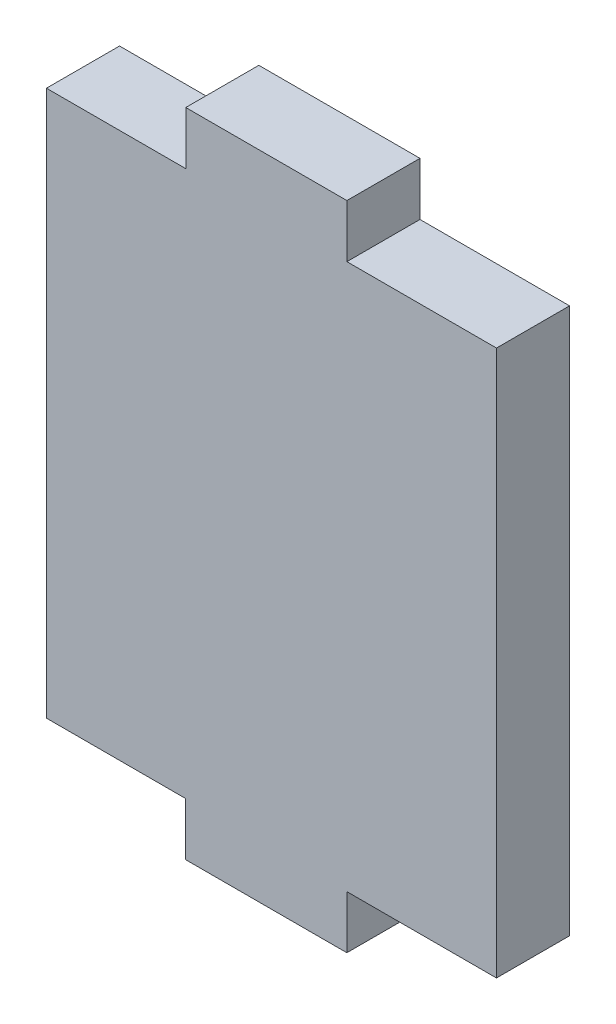
ISO-10303-21;
HEADER;
FILE_DESCRIPTION(('STEP AP214'),'2;1');
FILE_NAME('part.step','',(''),(''),'','','');
FILE_SCHEMA(('AUTOMOTIVE_DESIGN { 1 0 10303 214 1 1 1 1 }'));
ENDSEC;
DATA;
#1=APPLICATION_CONTEXT('core data for automotive mechanical design processes');
#2=APPLICATION_PROTOCOL_DEFINITION('international standard','automotive_design',2000,#1);
#3=PRODUCT_CONTEXT('',#1,'mechanical');
#4=PRODUCT('Part','Part','',(#3));
#5=PRODUCT_RELATED_PRODUCT_CATEGORY('part','',(#4));
#6=PRODUCT_DEFINITION_FORMATION('','',#4);
#7=PRODUCT_DEFINITION_CONTEXT('part definition',#1,'design');
#8=PRODUCT_DEFINITION('design','',#6,#7);
#9=PRODUCT_DEFINITION_SHAPE('','',#8);
#10=(LENGTH_UNIT() NAMED_UNIT(*) SI_UNIT(.MILLI.,.METRE.));
#11=(NAMED_UNIT(*) PLANE_ANGLE_UNIT() SI_UNIT($,.RADIAN.));
#12=(NAMED_UNIT(*) SI_UNIT($,.STERADIAN.) SOLID_ANGLE_UNIT());
#13=UNCERTAINTY_MEASURE_WITH_UNIT(LENGTH_MEASURE(1.E-05),#10,'distance_accuracy_value','');
#14=(GEOMETRIC_REPRESENTATION_CONTEXT(3) GLOBAL_UNCERTAINTY_ASSIGNED_CONTEXT((#13)) GLOBAL_UNIT_ASSIGNED_CONTEXT((#10,
#11,#12)) REPRESENTATION_CONTEXT('',''));
#15=CARTESIAN_POINT('',(0.,0.,0.));
#16=DIRECTION('',(0.,0.,1.));
#17=DIRECTION('',(1.,0.,0.));
#18=AXIS2_PLACEMENT_3D('',#15,#16,#17);
#19=CARTESIAN_POINT('',(0.,0.,3.175));
#20=DIRECTION('',(0.,1.,0.));
#21=DIRECTION('',(0.,0.,1.));
#22=AXIS2_PLACEMENT_3D('',#19,#20,#21);
#23=PLANE('',#22);
#24=DIRECTION('',(0.,0.,1.));
#25=VECTOR('',#24,1.);
#26=CARTESIAN_POINT('',(13.5,0.,0.));
#27=LINE('',#26,#25);
#28=CARTESIAN_POINT('',(13.5,0.,0.));
#29=VERTEX_POINT('',#28);
#30=CARTESIAN_POINT('',(13.5,0.,3.175));
#31=VERTEX_POINT('',#30);
#32=EDGE_CURVE('E207',#29,#31,#27,.T.);
#33=ORIENTED_EDGE('',*,*,#32,.F.);
#34=DIRECTION('',(1.,0.,0.));
#35=VECTOR('',#34,1.);
#36=CARTESIAN_POINT('',(0.,0.,0.));
#37=LINE('',#36,#35);
#38=CARTESIAN_POINT('',(20.,0.,0.));
#39=VERTEX_POINT('',#38);
#40=EDGE_CURVE('E165',#29,#39,#37,.T.);
#41=ORIENTED_EDGE('',*,*,#40,.T.);
#42=DIRECTION('',(0.,0.,-1.));
#43=VECTOR('',#42,1.);
#44=CARTESIAN_POINT('',(20.,0.,3.175));
#45=LINE('',#44,#43);
#46=CARTESIAN_POINT('',(20.,0.,3.175));
#47=VERTEX_POINT('',#46);
#48=EDGE_CURVE('E47',#47,#39,#45,.T.);
#49=ORIENTED_EDGE('',*,*,#48,.F.);
#50=DIRECTION('',(1.,0.,0.));
#51=VECTOR('',#50,1.);
#52=CARTESIAN_POINT('',(0.,0.,3.175));
#53=LINE('',#52,#51);
#54=EDGE_CURVE('E146',#31,#47,#53,.T.);
#55=ORIENTED_EDGE('',*,*,#54,.F.);
#56=EDGE_LOOP('',(#33,#41,#49,#55));
#57=FACE_BOUND('',#56,.T.);
#58=ADVANCED_FACE('F38',(#57),#23,.F.);
#59=CARTESIAN_POINT('',(0.,23.7,3.175));
#60=DIRECTION('',(0.,-1.,0.));
#61=DIRECTION('',(0.,0.,-1.));
#62=AXIS2_PLACEMENT_3D('',#59,#60,#61);
#63=PLANE('',#62);
#64=DIRECTION('',(-1.,0.,0.));
#65=VECTOR('',#64,1.);
#66=CARTESIAN_POINT('',(0.,23.7,0.));
#67=LINE('',#66,#65);
#68=CARTESIAN_POINT('',(6.502051165,23.7,0.));
#69=VERTEX_POINT('',#68);
#70=CARTESIAN_POINT('',(0.449999999999998,23.7,0.));
#71=VERTEX_POINT('',#70);
#72=EDGE_CURVE('E168',#69,#71,#67,.T.);
#73=ORIENTED_EDGE('',*,*,#72,.T.);
#74=DIRECTION('',(0.,0.,1.));
#75=VECTOR('',#74,1.);
#76=CARTESIAN_POINT('',(0.449999999999997,23.7,-6.825));
#77=LINE('',#76,#75);
#78=CARTESIAN_POINT('',(0.449999999999997,23.7,3.175));
#79=VERTEX_POINT('',#78);
#80=EDGE_CURVE('E53',#71,#79,#77,.T.);
#81=ORIENTED_EDGE('',*,*,#80,.T.);
#82=DIRECTION('',(-1.,0.,0.));
#83=VECTOR('',#82,1.);
#84=CARTESIAN_POINT('',(0.,23.7,3.175));
#85=LINE('',#84,#83);
#86=CARTESIAN_POINT('',(6.502051165,23.7,3.175));
#87=VERTEX_POINT('',#86);
#88=EDGE_CURVE('E138',#87,#79,#85,.T.);
#89=ORIENTED_EDGE('',*,*,#88,.F.);
#90=DIRECTION('',(0.,0.,1.));
#91=VECTOR('',#90,1.);
#92=CARTESIAN_POINT('',(6.502051165,23.7,0.));
#93=LINE('',#92,#91);
#94=EDGE_CURVE('E153',#69,#87,#93,.T.);
#95=ORIENTED_EDGE('',*,*,#94,.F.);
#96=EDGE_LOOP('',(#73,#81,#89,#95));
#97=FACE_BOUND('',#96,.T.);
#98=ADVANCED_FACE('F254',(#97),#63,.F.);
#99=CARTESIAN_POINT('',(0.45,0.,3.175));
#100=VERTEX_POINT('',#99);
#101=CARTESIAN_POINT('',(6.5,0.,3.175));
#102=VERTEX_POINT('',#101);
#103=EDGE_CURVE('E61',#100,#102,#53,.T.);
#104=ORIENTED_EDGE('',*,*,#103,.F.);
#105=DIRECTION('',(0.,0.,1.));
#106=VECTOR('',#105,1.);
#107=CARTESIAN_POINT('',(0.45,0.,-6.825));
#108=LINE('',#107,#106);
#109=CARTESIAN_POINT('',(0.45,0.,0.));
#110=VERTEX_POINT('',#109);
#111=EDGE_CURVE('E127',#110,#100,#108,.T.);
#112=ORIENTED_EDGE('',*,*,#111,.F.);
#113=CARTESIAN_POINT('',(6.5,0.,0.));
#114=VERTEX_POINT('',#113);
#115=EDGE_CURVE('E161',#110,#114,#37,.T.);
#116=ORIENTED_EDGE('',*,*,#115,.T.);
#117=DIRECTION('',(0.,0.,1.));
#118=VECTOR('',#117,1.);
#119=CARTESIAN_POINT('',(6.5,0.,0.));
#120=LINE('',#119,#118);
#121=EDGE_CURVE('E143',#114,#102,#120,.T.);
#122=ORIENTED_EDGE('',*,*,#121,.T.);
#123=EDGE_LOOP('',(#104,#112,#116,#122));
#124=FACE_BOUND('',#123,.T.);
#125=ADVANCED_FACE('F40',(#124),#23,.F.);
#126=CARTESIAN_POINT('',(20.,0.,3.175));
#127=DIRECTION('',(-1.,0.,0.));
#128=DIRECTION('',(0.,0.,1.));
#129=AXIS2_PLACEMENT_3D('',#126,#127,#128);
#130=PLANE('',#129);
#131=DIRECTION('',(0.,1.,0.));
#132=VECTOR('',#131,1.);
#133=CARTESIAN_POINT('',(20.,0.,0.));
#134=LINE('',#133,#132);
#135=CARTESIAN_POINT('',(20.,23.7,0.));
#136=VERTEX_POINT('',#135);
#137=EDGE_CURVE('E164',#39,#136,#134,.T.);
#138=ORIENTED_EDGE('',*,*,#137,.T.);
#139=DIRECTION('',(0.,0.,-1.));
#140=VECTOR('',#139,1.);
#141=CARTESIAN_POINT('',(20.,23.7,3.175));
#142=LINE('',#141,#140);
#143=CARTESIAN_POINT('',(20.,23.7,3.175));
#144=VERTEX_POINT('',#143);
#145=EDGE_CURVE('E160',#144,#136,#142,.T.);
#146=ORIENTED_EDGE('',*,*,#145,.F.);
#147=DIRECTION('',(0.,1.,0.));
#148=VECTOR('',#147,1.);
#149=CARTESIAN_POINT('',(20.,0.,3.175));
#150=LINE('',#149,#148);
#151=EDGE_CURVE('E145',#47,#144,#150,.T.);
#152=ORIENTED_EDGE('',*,*,#151,.F.);
#153=ORIENTED_EDGE('',*,*,#48,.T.);
#154=EDGE_LOOP('',(#138,#146,#152,#153));
#155=FACE_BOUND('',#154,.T.);
#156=ADVANCED_FACE('F180',(#155),#130,.F.);
#157=CARTESIAN_POINT('',(13.502051165,23.7,0.));
#158=VERTEX_POINT('',#157);
#159=EDGE_CURVE('E151',#136,#158,#67,.T.);
#160=ORIENTED_EDGE('',*,*,#159,.T.);
#161=DIRECTION('',(0.,0.,1.));
#162=VECTOR('',#161,1.);
#163=CARTESIAN_POINT('',(13.502051165,23.7,0.));
#164=LINE('',#163,#162);
#165=CARTESIAN_POINT('',(13.502051165,23.7,3.175));
#166=VERTEX_POINT('',#165);
#167=EDGE_CURVE('E197',#158,#166,#164,.T.);
#168=ORIENTED_EDGE('',*,*,#167,.T.);
#169=EDGE_CURVE('E156',#144,#166,#85,.T.);
#170=ORIENTED_EDGE('',*,*,#169,.F.);
#171=ORIENTED_EDGE('',*,*,#145,.T.);
#172=EDGE_LOOP('',(#160,#168,#170,#171));
#173=FACE_BOUND('',#172,.T.);
#174=ADVANCED_FACE('F195',(#173),#63,.F.);
#175=CARTESIAN_POINT('',(0.,0.,3.175));
#176=DIRECTION('',(0.,0.,-1.));
#177=DIRECTION('',(-1.,0.,0.));
#178=AXIS2_PLACEMENT_3D('',#175,#176,#177);
#179=PLANE('',#178);
#180=ORIENTED_EDGE('',*,*,#88,.T.);
#181=DIRECTION('',(0.,1.,0.));
#182=VECTOR('',#181,1.);
#183=CARTESIAN_POINT('',(0.449999999999997,23.7,3.175));
#184=LINE('',#183,#182);
#185=EDGE_CURVE('E129',#100,#79,#184,.T.);
#186=ORIENTED_EDGE('',*,*,#185,.F.);
#187=ORIENTED_EDGE('',*,*,#103,.T.);
#188=DIRECTION('',(0.,-1.,0.));
#189=VECTOR('',#188,1.);
#190=CARTESIAN_POINT('',(6.5,0.,3.175));
#191=LINE('',#190,#189);
#192=CARTESIAN_POINT('',(6.5,-2.3,3.175));
#193=VERTEX_POINT('',#192);
#194=EDGE_CURVE('E257',#102,#193,#191,.T.);
#195=ORIENTED_EDGE('',*,*,#194,.T.);
#196=DIRECTION('',(1.,0.,0.));
#197=VECTOR('',#196,1.);
#198=CARTESIAN_POINT('',(6.5,-2.3,3.175));
#199=LINE('',#198,#197);
#200=CARTESIAN_POINT('',(13.5,-2.3,3.175));
#201=VERTEX_POINT('',#200);
#202=EDGE_CURVE('E260',#193,#201,#199,.T.);
#203=ORIENTED_EDGE('',*,*,#202,.T.);
#204=DIRECTION('',(0.,1.,0.));
#205=VECTOR('',#204,1.);
#206=CARTESIAN_POINT('',(13.5,0.,3.175));
#207=LINE('',#206,#205);
#208=EDGE_CURVE('E205',#201,#31,#207,.T.);
#209=ORIENTED_EDGE('',*,*,#208,.T.);
#210=ORIENTED_EDGE('',*,*,#54,.T.);
#211=ORIENTED_EDGE('',*,*,#151,.T.);
#212=ORIENTED_EDGE('',*,*,#169,.T.);
#213=DIRECTION('',(0.,1.,0.));
#214=VECTOR('',#213,1.);
#215=CARTESIAN_POINT('',(13.502051165,23.7,3.175));
#216=LINE('',#215,#214);
#217=CARTESIAN_POINT('',(13.502051165,26.,3.175));
#218=VERTEX_POINT('',#217);
#219=EDGE_CURVE('E200',#166,#218,#216,.T.);
#220=ORIENTED_EDGE('',*,*,#219,.T.);
#221=DIRECTION('',(-1.,0.,0.));
#222=VECTOR('',#221,1.);
#223=CARTESIAN_POINT('',(6.502051165,26.,3.175));
#224=LINE('',#223,#222);
#225=CARTESIAN_POINT('',(6.502051165,26.,3.175));
#226=VERTEX_POINT('',#225);
#227=EDGE_CURVE('E226',#218,#226,#224,.T.);
#228=ORIENTED_EDGE('',*,*,#227,.T.);
#229=DIRECTION('',(0.,-1.,0.));
#230=VECTOR('',#229,1.);
#231=CARTESIAN_POINT('',(6.502051165,23.7,3.175));
#232=LINE('',#231,#230);
#233=EDGE_CURVE('E214',#226,#87,#232,.T.);
#234=ORIENTED_EDGE('',*,*,#233,.T.);
#235=EDGE_LOOP('',(#180,#186,#187,#195,#203,#209,#210,#211,#212,#220,#228,#234));
#236=FACE_BOUND('',#235,.T.);
#237=ADVANCED_FACE('F135',(#236),#179,.F.);
#238=CARTESIAN_POINT('',(0.,0.,0.));
#239=DIRECTION('',(0.,0.,-1.));
#240=DIRECTION('',(-1.,0.,0.));
#241=AXIS2_PLACEMENT_3D('',#238,#239,#240);
#242=PLANE('',#241);
#243=DIRECTION('',(0.,-1.,0.));
#244=VECTOR('',#243,1.);
#245=CARTESIAN_POINT('',(0.45,0.,0.));
#246=LINE('',#245,#244);
#247=EDGE_CURVE('E11',#71,#110,#246,.T.);
#248=ORIENTED_EDGE('',*,*,#247,.F.);
#249=ORIENTED_EDGE('',*,*,#72,.F.);
#250=DIRECTION('',(0.,-1.,0.));
#251=VECTOR('',#250,1.);
#252=CARTESIAN_POINT('',(6.502051165,23.7,0.));
#253=LINE('',#252,#251);
#254=CARTESIAN_POINT('',(6.502051165,26.,0.));
#255=VERTEX_POINT('',#254);
#256=EDGE_CURVE('E223',#255,#69,#253,.T.);
#257=ORIENTED_EDGE('',*,*,#256,.F.);
#258=DIRECTION('',(-1.,0.,0.));
#259=VECTOR('',#258,1.);
#260=CARTESIAN_POINT('',(6.502051165,26.,0.));
#261=LINE('',#260,#259);
#262=CARTESIAN_POINT('',(13.502051165,26.,0.));
#263=VERTEX_POINT('',#262);
#264=EDGE_CURVE('E229',#263,#255,#261,.T.);
#265=ORIENTED_EDGE('',*,*,#264,.F.);
#266=DIRECTION('',(0.,1.,0.));
#267=VECTOR('',#266,1.);
#268=CARTESIAN_POINT('',(13.502051165,23.7,0.));
#269=LINE('',#268,#267);
#270=EDGE_CURVE('E192',#158,#263,#269,.T.);
#271=ORIENTED_EDGE('',*,*,#270,.F.);
#272=ORIENTED_EDGE('',*,*,#159,.F.);
#273=ORIENTED_EDGE('',*,*,#137,.F.);
#274=ORIENTED_EDGE('',*,*,#40,.F.);
#275=DIRECTION('',(0.,1.,0.));
#276=VECTOR('',#275,1.);
#277=CARTESIAN_POINT('',(13.5,0.,0.));
#278=LINE('',#277,#276);
#279=CARTESIAN_POINT('',(13.5,-2.3,0.));
#280=VERTEX_POINT('',#279);
#281=EDGE_CURVE('E222',#280,#29,#278,.T.);
#282=ORIENTED_EDGE('',*,*,#281,.F.);
#283=DIRECTION('',(1.,0.,0.));
#284=VECTOR('',#283,1.);
#285=CARTESIAN_POINT('',(6.5,-2.3,0.));
#286=LINE('',#285,#284);
#287=CARTESIAN_POINT('',(6.5,-2.3,0.));
#288=VERTEX_POINT('',#287);
#289=EDGE_CURVE('E267',#288,#280,#286,.T.);
#290=ORIENTED_EDGE('',*,*,#289,.F.);
#291=DIRECTION('',(0.,-1.,0.));
#292=VECTOR('',#291,1.);
#293=CARTESIAN_POINT('',(6.5,0.,0.));
#294=LINE('',#293,#292);
#295=EDGE_CURVE('E263',#114,#288,#294,.T.);
#296=ORIENTED_EDGE('',*,*,#295,.F.);
#297=ORIENTED_EDGE('',*,*,#115,.F.);
#298=EDGE_LOOP('',(#248,#249,#257,#265,#271,#272,#273,#274,#282,#290,#296,#297));
#299=FACE_BOUND('',#298,.T.);
#300=ADVANCED_FACE('F187',(#299),#242,.T.);
#301=CARTESIAN_POINT('',(6.502051165,23.7,0.));
#302=DIRECTION('',(-1.,0.,0.));
#303=DIRECTION('',(0.,-1.,0.));
#304=AXIS2_PLACEMENT_3D('',#301,#302,#303);
#305=PLANE('',#304);
#306=ORIENTED_EDGE('',*,*,#233,.F.);
#307=DIRECTION('',(0.,0.,1.));
#308=VECTOR('',#307,1.);
#309=CARTESIAN_POINT('',(6.502051165,26.,0.));
#310=LINE('',#309,#308);
#311=EDGE_CURVE('E239',#255,#226,#310,.T.);
#312=ORIENTED_EDGE('',*,*,#311,.F.);
#313=ORIENTED_EDGE('',*,*,#256,.T.);
#314=ORIENTED_EDGE('',*,*,#94,.T.);
#315=EDGE_LOOP('',(#306,#312,#313,#314));
#316=FACE_BOUND('',#315,.T.);
#317=ADVANCED_FACE('F249',(#316),#305,.T.);
#318=CARTESIAN_POINT('',(6.502051165,26.,0.));
#319=DIRECTION('',(0.,1.,0.));
#320=DIRECTION('',(0.,0.,1.));
#321=AXIS2_PLACEMENT_3D('',#318,#319,#320);
#322=PLANE('',#321);
#323=ORIENTED_EDGE('',*,*,#227,.F.);
#324=DIRECTION('',(0.,0.,1.));
#325=VECTOR('',#324,1.);
#326=CARTESIAN_POINT('',(13.502051165,26.,0.));
#327=LINE('',#326,#325);
#328=EDGE_CURVE('E242',#263,#218,#327,.T.);
#329=ORIENTED_EDGE('',*,*,#328,.F.);
#330=ORIENTED_EDGE('',*,*,#264,.T.);
#331=ORIENTED_EDGE('',*,*,#311,.T.);
#332=EDGE_LOOP('',(#323,#329,#330,#331));
#333=FACE_BOUND('',#332,.T.);
#334=ADVANCED_FACE('F312',(#333),#322,.T.);
#335=CARTESIAN_POINT('',(13.502051165,23.7,0.));
#336=DIRECTION('',(1.,0.,0.));
#337=DIRECTION('',(0.,0.,-1.));
#338=AXIS2_PLACEMENT_3D('',#335,#336,#337);
#339=PLANE('',#338);
#340=ORIENTED_EDGE('',*,*,#219,.F.);
#341=ORIENTED_EDGE('',*,*,#167,.F.);
#342=ORIENTED_EDGE('',*,*,#270,.T.);
#343=ORIENTED_EDGE('',*,*,#328,.T.);
#344=EDGE_LOOP('',(#340,#341,#342,#343));
#345=FACE_BOUND('',#344,.T.);
#346=ADVANCED_FACE('F288',(#345),#339,.T.);
#347=CARTESIAN_POINT('',(6.5,0.,0.));
#348=DIRECTION('',(-1.,0.,0.));
#349=DIRECTION('',(0.,0.,1.));
#350=AXIS2_PLACEMENT_3D('',#347,#348,#349);
#351=PLANE('',#350);
#352=ORIENTED_EDGE('',*,*,#194,.F.);
#353=ORIENTED_EDGE('',*,*,#121,.F.);
#354=ORIENTED_EDGE('',*,*,#295,.T.);
#355=DIRECTION('',(0.,0.,1.));
#356=VECTOR('',#355,1.);
#357=CARTESIAN_POINT('',(6.5,-2.3,0.));
#358=LINE('',#357,#356);
#359=EDGE_CURVE('E216',#288,#193,#358,.T.);
#360=ORIENTED_EDGE('',*,*,#359,.T.);
#361=EDGE_LOOP('',(#352,#353,#354,#360));
#362=FACE_BOUND('',#361,.T.);
#363=ADVANCED_FACE('F281',(#362),#351,.T.);
#364=CARTESIAN_POINT('',(13.5,0.,0.));
#365=DIRECTION('',(1.,0.,0.));
#366=DIRECTION('',(0.,0.,-1.));
#367=AXIS2_PLACEMENT_3D('',#364,#365,#366);
#368=PLANE('',#367);
#369=ORIENTED_EDGE('',*,*,#208,.F.);
#370=DIRECTION('',(0.,0.,1.));
#371=VECTOR('',#370,1.);
#372=CARTESIAN_POINT('',(13.5,-2.3,0.));
#373=LINE('',#372,#371);
#374=EDGE_CURVE('E210',#280,#201,#373,.T.);
#375=ORIENTED_EDGE('',*,*,#374,.F.);
#376=ORIENTED_EDGE('',*,*,#281,.T.);
#377=ORIENTED_EDGE('',*,*,#32,.T.);
#378=EDGE_LOOP('',(#369,#375,#376,#377));
#379=FACE_BOUND('',#378,.T.);
#380=ADVANCED_FACE('F279',(#379),#368,.T.);
#381=CARTESIAN_POINT('',(6.5,-2.3,0.));
#382=DIRECTION('',(0.,-1.,0.));
#383=DIRECTION('',(0.,0.,-1.));
#384=AXIS2_PLACEMENT_3D('',#381,#382,#383);
#385=PLANE('',#384);
#386=ORIENTED_EDGE('',*,*,#202,.F.);
#387=ORIENTED_EDGE('',*,*,#359,.F.);
#388=ORIENTED_EDGE('',*,*,#289,.T.);
#389=ORIENTED_EDGE('',*,*,#374,.T.);
#390=EDGE_LOOP('',(#386,#387,#388,#389));
#391=FACE_BOUND('',#390,.T.);
#392=ADVANCED_FACE('F277',(#391),#385,.T.);
#393=CARTESIAN_POINT('',(0.449999999999997,23.7,-6.825));
#394=DIRECTION('',(1.,0.,0.));
#395=DIRECTION('',(0.,1.,0.));
#396=AXIS2_PLACEMENT_3D('',#393,#394,#395);
#397=PLANE('',#396);
#398=ORIENTED_EDGE('',*,*,#247,.T.);
#399=ORIENTED_EDGE('',*,*,#111,.T.);
#400=ORIENTED_EDGE('',*,*,#185,.T.);
#401=ORIENTED_EDGE('',*,*,#80,.F.);
#402=EDGE_LOOP('',(#398,#399,#400,#401));
#403=FACE_BOUND('',#402,.T.);
#404=ADVANCED_FACE('F128',(#403),#397,.F.);
#405=CLOSED_SHELL('',(#58,#98,#125,#156,#174,#237,#300,#317,#334,#346,#363,#380,#392,#404));
#406=MANIFOLD_SOLID_BREP('B2',#405);
#407=ADVANCED_BREP_SHAPE_REPRESENTATION('',(#18,#406),#14);
#408=SHAPE_DEFINITION_REPRESENTATION(#9,#407);
ENDSEC;
END-ISO-10303-21;
